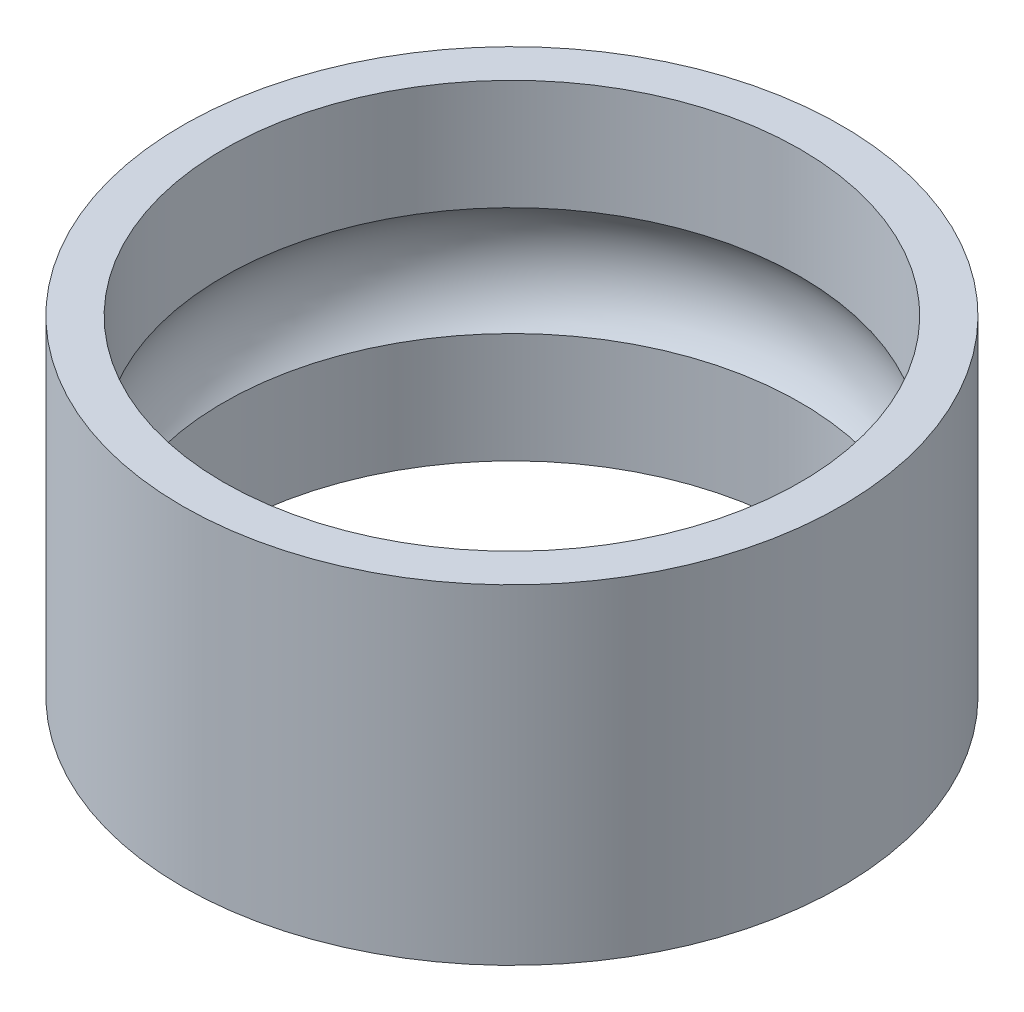
ISO-10303-21;
HEADER;
FILE_DESCRIPTION(('STEP AP214'),'2;1');
FILE_NAME('part.step','',(''),(''),'','','');
FILE_SCHEMA(('AUTOMOTIVE_DESIGN { 1 0 10303 214 1 1 1 1 }'));
ENDSEC;
DATA;
#1=APPLICATION_CONTEXT('core data for automotive mechanical design processes');
#2=APPLICATION_PROTOCOL_DEFINITION('international standard','automotive_design',2000,#1);
#3=PRODUCT_CONTEXT('',#1,'mechanical');
#4=PRODUCT('Part','Part','',(#3));
#5=PRODUCT_RELATED_PRODUCT_CATEGORY('part','',(#4));
#6=PRODUCT_DEFINITION_FORMATION('','',#4);
#7=PRODUCT_DEFINITION_CONTEXT('part definition',#1,'design');
#8=PRODUCT_DEFINITION('design','',#6,#7);
#9=PRODUCT_DEFINITION_SHAPE('','',#8);
#10=(LENGTH_UNIT() NAMED_UNIT(*) SI_UNIT(.MILLI.,.METRE.));
#11=(NAMED_UNIT(*) PLANE_ANGLE_UNIT() SI_UNIT($,.RADIAN.));
#12=(NAMED_UNIT(*) SI_UNIT($,.STERADIAN.) SOLID_ANGLE_UNIT());
#13=UNCERTAINTY_MEASURE_WITH_UNIT(LENGTH_MEASURE(1.E-05),#10,'distance_accuracy_value','');
#14=(GEOMETRIC_REPRESENTATION_CONTEXT(3) GLOBAL_UNCERTAINTY_ASSIGNED_CONTEXT((#13)) GLOBAL_UNIT_ASSIGNED_CONTEXT((#10,
#11,#12)) REPRESENTATION_CONTEXT('',''));
#15=CARTESIAN_POINT('',(0.,0.,0.));
#16=DIRECTION('',(0.,0.,1.));
#17=DIRECTION('',(1.,0.,0.));
#18=AXIS2_PLACEMENT_3D('',#15,#16,#17);
#19=CARTESIAN_POINT('',(0.,2.,0.));
#20=DIRECTION('',(0.,-1.,0.));
#21=DIRECTION('',(0.,0.,-1.));
#22=AXIS2_PLACEMENT_3D('',#19,#20,#21);
#23=CYLINDRICAL_SURFACE('',#22,3.5);
#24=CARTESIAN_POINT('',(0.,2.,0.));
#25=DIRECTION('',(0.,1.,0.));
#26=DIRECTION('',(0.,0.,1.));
#27=AXIS2_PLACEMENT_3D('',#24,#25,#26);
#28=CIRCLE('',#27,3.5);
#29=CARTESIAN_POINT('',(0.,2.,3.5));
#30=VERTEX_POINT('',#29);
#31=EDGE_CURVE('E52',#30,#30,#28,.T.);
#32=ORIENTED_EDGE('',*,*,#31,.T.);
#33=EDGE_LOOP('',(#32));
#34=FACE_BOUND('',#33,.T.);
#35=CARTESIAN_POINT('',(0.,0.661437827766148,0.));
#36=DIRECTION('',(0.,-1.,0.));
#37=DIRECTION('',(0.,0.,-1.));
#38=AXIS2_PLACEMENT_3D('',#35,#36,#37);
#39=CIRCLE('',#38,3.5);
#40=CARTESIAN_POINT('',(0.,0.661437827766148,-3.5));
#41=VERTEX_POINT('',#40);
#42=EDGE_CURVE('E40',#41,#41,#39,.T.);
#43=ORIENTED_EDGE('',*,*,#42,.T.);
#44=EDGE_LOOP('',(#43));
#45=FACE_BOUND('',#44,.T.);
#46=ADVANCED_FACE('F36',(#34,#45),#23,.F.);
#47=CARTESIAN_POINT('',(0.,-2.,0.));
#48=DIRECTION('',(0.,1.,0.));
#49=DIRECTION('',(0.,0.,1.));
#50=AXIS2_PLACEMENT_3D('',#47,#48,#49);
#51=CIRCLE('',#50,3.5);
#52=CARTESIAN_POINT('',(0.,-2.,3.5));
#53=VERTEX_POINT('',#52);
#54=EDGE_CURVE('E55',#53,#53,#51,.T.);
#55=ORIENTED_EDGE('',*,*,#54,.F.);
#56=EDGE_LOOP('',(#55));
#57=FACE_BOUND('',#56,.T.);
#58=CARTESIAN_POINT('',(0.,-0.661437827766148,0.));
#59=DIRECTION('',(0.,1.,0.));
#60=DIRECTION('',(0.,0.,1.));
#61=AXIS2_PLACEMENT_3D('',#58,#59,#60);
#62=CIRCLE('',#61,3.5);
#63=CARTESIAN_POINT('',(0.,-0.661437827766148,3.5));
#64=VERTEX_POINT('',#63);
#65=EDGE_CURVE('E57',#64,#64,#62,.T.);
#66=ORIENTED_EDGE('',*,*,#65,.T.);
#67=EDGE_LOOP('',(#66));
#68=FACE_BOUND('',#67,.T.);
#69=ADVANCED_FACE('F77',(#57,#68),#23,.F.);
#70=CARTESIAN_POINT('',(0.,2.,0.));
#71=DIRECTION('',(0.,1.,0.));
#72=DIRECTION('',(0.,0.,1.));
#73=AXIS2_PLACEMENT_3D('',#70,#71,#72);
#74=PLANE('',#73);
#75=CARTESIAN_POINT('',(0.,2.,0.));
#76=DIRECTION('',(0.,1.,0.));
#77=DIRECTION('',(0.,0.,1.));
#78=AXIS2_PLACEMENT_3D('',#75,#76,#77);
#79=CIRCLE('',#78,4.);
#80=CARTESIAN_POINT('',(0.,2.,4.));
#81=VERTEX_POINT('',#80);
#82=EDGE_CURVE('E10',#81,#81,#79,.T.);
#83=ORIENTED_EDGE('',*,*,#82,.T.);
#84=EDGE_LOOP('',(#83));
#85=FACE_BOUND('',#84,.T.);
#86=ORIENTED_EDGE('',*,*,#31,.F.);
#87=EDGE_LOOP('',(#86));
#88=FACE_BOUND('',#87,.T.);
#89=ADVANCED_FACE('F74',(#85,#88),#74,.T.);
#90=CARTESIAN_POINT('',(0.,-2.,0.));
#91=DIRECTION('',(0.,1.,0.));
#92=DIRECTION('',(0.,0.,1.));
#93=AXIS2_PLACEMENT_3D('',#90,#91,#92);
#94=PLANE('',#93);
#95=CARTESIAN_POINT('',(0.,-2.,0.));
#96=DIRECTION('',(0.,1.,0.));
#97=DIRECTION('',(0.,0.,1.));
#98=AXIS2_PLACEMENT_3D('',#95,#96,#97);
#99=CIRCLE('',#98,4.);
#100=CARTESIAN_POINT('',(0.,-2.,4.));
#101=VERTEX_POINT('',#100);
#102=EDGE_CURVE('E45',#101,#101,#99,.T.);
#103=ORIENTED_EDGE('',*,*,#102,.F.);
#104=EDGE_LOOP('',(#103));
#105=FACE_BOUND('',#104,.T.);
#106=ORIENTED_EDGE('',*,*,#54,.T.);
#107=EDGE_LOOP('',(#106));
#108=FACE_BOUND('',#107,.T.);
#109=ADVANCED_FACE('F76',(#105,#108),#94,.F.);
#110=CARTESIAN_POINT('',(0.,2.,0.));
#111=DIRECTION('',(0.,-1.,0.));
#112=DIRECTION('',(0.,0.,-1.));
#113=AXIS2_PLACEMENT_3D('',#110,#111,#112);
#114=CYLINDRICAL_SURFACE('',#113,4.);
#115=ORIENTED_EDGE('',*,*,#82,.F.);
#116=EDGE_LOOP('',(#115));
#117=FACE_BOUND('',#116,.T.);
#118=ORIENTED_EDGE('',*,*,#102,.T.);
#119=EDGE_LOOP('',(#118));
#120=FACE_BOUND('',#119,.T.);
#121=ADVANCED_FACE('F38',(#117,#120),#114,.T.);
#122=CARTESIAN_POINT('',(0.,0.,0.));
#123=DIRECTION('',(0.,1.,0.));
#124=DIRECTION('',(0.,0.,1.));
#125=AXIS2_PLACEMENT_3D('',#122,#123,#124);
#126=TOROIDAL_SURFACE('',#125,2.75,1.);
#127=ORIENTED_EDGE('',*,*,#42,.F.);
#128=EDGE_LOOP('',(#127));
#129=FACE_BOUND('',#128,.T.);
#130=ORIENTED_EDGE('',*,*,#65,.F.);
#131=EDGE_LOOP('',(#130));
#132=FACE_BOUND('',#131,.T.);
#133=ADVANCED_FACE('F90',(#129,#132),#126,.F.);
#134=CLOSED_SHELL('',(#46,#69,#89,#109,#121,#133));
#135=MANIFOLD_SOLID_BREP('B2',#134);
#136=ADVANCED_BREP_SHAPE_REPRESENTATION('',(#18,#135),#14);
#137=SHAPE_DEFINITION_REPRESENTATION(#9,#136);
ENDSEC;
END-ISO-10303-21;
